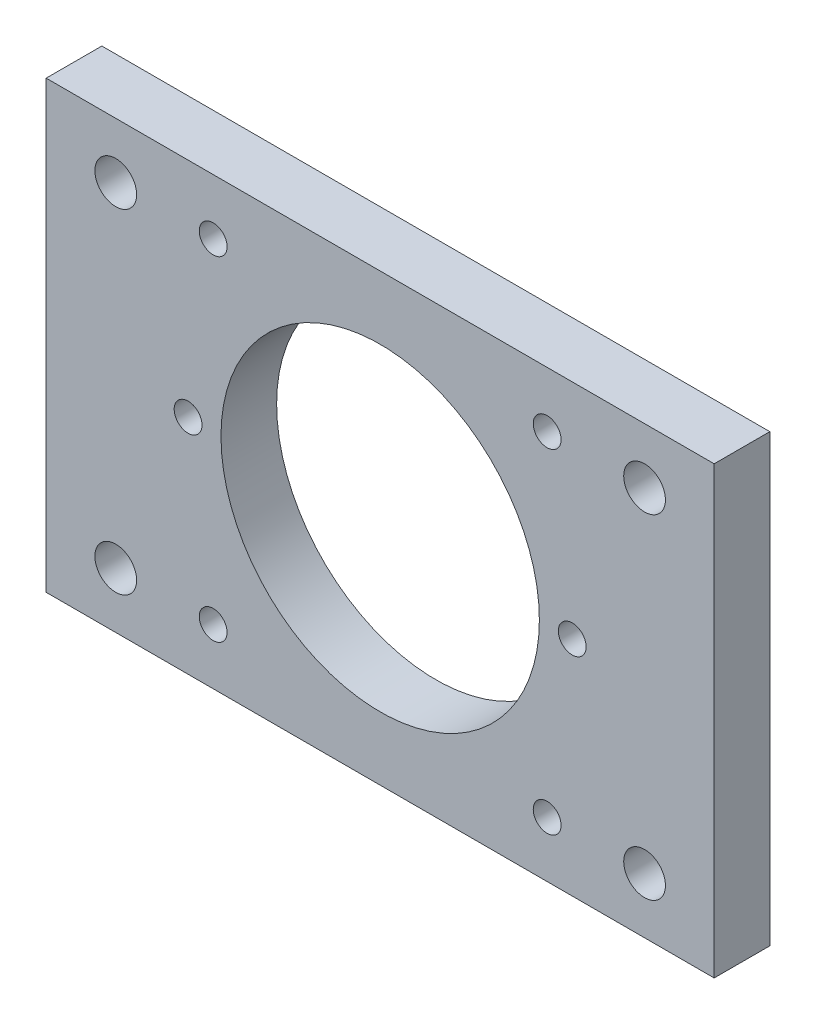
ISO-10303-21;
HEADER;
FILE_DESCRIPTION(('STEP AP214'),'2;1');
FILE_NAME('part.step','',(''),(''),'','','');
FILE_SCHEMA(('AUTOMOTIVE_DESIGN { 1 0 10303 214 1 1 1 1 }'));
ENDSEC;
DATA;
#1=APPLICATION_CONTEXT('core data for automotive mechanical design processes');
#2=APPLICATION_PROTOCOL_DEFINITION('international standard','automotive_design',2000,#1);
#3=PRODUCT_CONTEXT('',#1,'mechanical');
#4=PRODUCT('Part','Part','',(#3));
#5=PRODUCT_RELATED_PRODUCT_CATEGORY('part','',(#4));
#6=PRODUCT_DEFINITION_FORMATION('','',#4);
#7=PRODUCT_DEFINITION_CONTEXT('part definition',#1,'design');
#8=PRODUCT_DEFINITION('design','',#6,#7);
#9=PRODUCT_DEFINITION_SHAPE('','',#8);
#10=(LENGTH_UNIT() NAMED_UNIT(*) SI_UNIT(.MILLI.,.METRE.));
#11=(NAMED_UNIT(*) PLANE_ANGLE_UNIT() SI_UNIT($,.RADIAN.));
#12=(NAMED_UNIT(*) SI_UNIT($,.STERADIAN.) SOLID_ANGLE_UNIT());
#13=UNCERTAINTY_MEASURE_WITH_UNIT(LENGTH_MEASURE(1.E-05),#10,'distance_accuracy_value','');
#14=(GEOMETRIC_REPRESENTATION_CONTEXT(3) GLOBAL_UNCERTAINTY_ASSIGNED_CONTEXT((#13)) GLOBAL_UNIT_ASSIGNED_CONTEXT((#10,
#11,#12)) REPRESENTATION_CONTEXT('',''));
#15=CARTESIAN_POINT('',(0.,0.,0.));
#16=DIRECTION('',(0.,0.,1.));
#17=DIRECTION('',(1.,0.,0.));
#18=AXIS2_PLACEMENT_3D('',#15,#16,#17);
#19=CARTESIAN_POINT('',(0.,50.8,6.35));
#20=DIRECTION('',(0.,0.,-1.));
#21=DIRECTION('',(-1.,0.,0.));
#22=AXIS2_PLACEMENT_3D('',#19,#20,#21);
#23=PLANE('',#22);
#24=CARTESIAN_POINT('',(57.15,44.45,6.35));
#25=DIRECTION('',(0.,0.,-1.));
#26=DIRECTION('',(-1.,0.,0.));
#27=AXIS2_PLACEMENT_3D('',#24,#25,#26);
#28=CIRCLE('',#27,1.5875);
#29=CARTESIAN_POINT('',(55.5625,44.45,6.35));
#30=VERTEX_POINT('',#29);
#31=EDGE_CURVE('E284',#30,#30,#28,.T.);
#32=ORIENTED_EDGE('',*,*,#31,.T.);
#33=EDGE_LOOP('',(#32));
#34=FACE_BOUND('',#33,.T.);
#35=CARTESIAN_POINT('',(19.05,44.4499999999999,6.35));
#36=DIRECTION('',(0.,0.,-1.));
#37=DIRECTION('',(-1.,0.,0.));
#38=AXIS2_PLACEMENT_3D('',#35,#36,#37);
#39=CIRCLE('',#38,1.5875);
#40=CARTESIAN_POINT('',(17.4625,44.4499999999999,6.35));
#41=VERTEX_POINT('',#40);
#42=EDGE_CURVE('E292',#41,#41,#39,.T.);
#43=ORIENTED_EDGE('',*,*,#42,.T.);
#44=EDGE_LOOP('',(#43));
#45=FACE_BOUND('',#44,.T.);
#46=CARTESIAN_POINT('',(57.15,6.34999999999998,6.35));
#47=DIRECTION('',(0.,0.,-1.));
#48=DIRECTION('',(-1.,0.,0.));
#49=AXIS2_PLACEMENT_3D('',#46,#47,#48);
#50=CIRCLE('',#49,1.5875);
#51=CARTESIAN_POINT('',(55.5625,6.34999999999998,6.35));
#52=VERTEX_POINT('',#51);
#53=EDGE_CURVE('E298',#52,#52,#50,.T.);
#54=ORIENTED_EDGE('',*,*,#53,.T.);
#55=EDGE_LOOP('',(#54));
#56=FACE_BOUND('',#55,.T.);
#57=CARTESIAN_POINT('',(19.05,6.34999999999997,6.35));
#58=DIRECTION('',(0.,0.,-1.));
#59=DIRECTION('',(-1.,0.,0.));
#60=AXIS2_PLACEMENT_3D('',#57,#58,#59);
#61=CIRCLE('',#60,1.5875);
#62=CARTESIAN_POINT('',(17.4625,6.34999999999997,6.35));
#63=VERTEX_POINT('',#62);
#64=EDGE_CURVE('E135',#63,#63,#61,.T.);
#65=ORIENTED_EDGE('',*,*,#64,.T.);
#66=EDGE_LOOP('',(#65));
#67=FACE_BOUND('',#66,.T.);
#68=CARTESIAN_POINT('',(7.93750000000001,44.45,6.35));
#69=DIRECTION('',(0.,0.,1.));
#70=DIRECTION('',(1.,0.,0.));
#71=AXIS2_PLACEMENT_3D('',#68,#69,#70);
#72=CIRCLE('',#71,2.38125);
#73=CARTESIAN_POINT('',(10.31875,44.45,6.35));
#74=VERTEX_POINT('',#73);
#75=EDGE_CURVE('E149',#74,#74,#72,.T.);
#76=ORIENTED_EDGE('',*,*,#75,.F.);
#77=EDGE_LOOP('',(#76));
#78=FACE_BOUND('',#77,.T.);
#79=CARTESIAN_POINT('',(68.2625,44.45,6.35));
#80=DIRECTION('',(0.,0.,-1.));
#81=DIRECTION('',(-1.,0.,0.));
#82=AXIS2_PLACEMENT_3D('',#79,#80,#81);
#83=CIRCLE('',#82,2.38125);
#84=CARTESIAN_POINT('',(65.88125,44.45,6.35));
#85=VERTEX_POINT('',#84);
#86=EDGE_CURVE('E155',#85,#85,#83,.T.);
#87=ORIENTED_EDGE('',*,*,#86,.T.);
#88=EDGE_LOOP('',(#87));
#89=FACE_BOUND('',#88,.T.);
#90=CARTESIAN_POINT('',(16.1881750645913,25.4,6.35));
#91=DIRECTION('',(0.,0.,-1.));
#92=DIRECTION('',(-1.,0.,0.));
#93=AXIS2_PLACEMENT_3D('',#90,#91,#92);
#94=CIRCLE('',#93,1.5875);
#95=CARTESIAN_POINT('',(14.6006750645913,25.4,6.35));
#96=VERTEX_POINT('',#95);
#97=EDGE_CURVE('E165',#96,#96,#94,.F.);
#98=ORIENTED_EDGE('',*,*,#97,.F.);
#99=EDGE_LOOP('',(#98));
#100=FACE_BOUND('',#99,.T.);
#101=DIRECTION('',(0.,-1.,0.));
#102=VECTOR('',#101,1.);
#103=CARTESIAN_POINT('',(0.,0.,6.35));
#104=LINE('',#103,#102);
#105=CARTESIAN_POINT('',(0.,50.8,6.35));
#106=VERTEX_POINT('',#105);
#107=CARTESIAN_POINT('',(0.,0.,6.35));
#108=VERTEX_POINT('',#107);
#109=EDGE_CURVE('E88',#106,#108,#104,.T.);
#110=ORIENTED_EDGE('',*,*,#109,.T.);
#111=DIRECTION('',(1.,0.,0.));
#112=VECTOR('',#111,1.);
#113=CARTESIAN_POINT('',(0.,0.,6.35));
#114=LINE('',#113,#112);
#115=CARTESIAN_POINT('',(76.2,0.,6.35));
#116=VERTEX_POINT('',#115);
#117=EDGE_CURVE('E83',#108,#116,#114,.T.);
#118=ORIENTED_EDGE('',*,*,#117,.T.);
#119=DIRECTION('',(0.,1.,0.));
#120=VECTOR('',#119,1.);
#121=CARTESIAN_POINT('',(76.2,0.,6.35));
#122=LINE('',#121,#120);
#123=CARTESIAN_POINT('',(76.2,50.8,6.35));
#124=VERTEX_POINT('',#123);
#125=EDGE_CURVE('E86',#116,#124,#122,.T.);
#126=ORIENTED_EDGE('',*,*,#125,.T.);
#127=DIRECTION('',(-1.,0.,0.));
#128=VECTOR('',#127,1.);
#129=CARTESIAN_POINT('',(0.,50.8,6.35));
#130=LINE('',#129,#128);
#131=EDGE_CURVE('E52',#124,#106,#130,.T.);
#132=ORIENTED_EDGE('',*,*,#131,.T.);
#133=EDGE_LOOP('',(#110,#118,#126,#132));
#134=FACE_BOUND('',#133,.T.);
#135=CARTESIAN_POINT('',(38.1,25.4,6.35));
#136=DIRECTION('',(0.,0.,-1.));
#137=DIRECTION('',(-1.,0.,0.));
#138=AXIS2_PLACEMENT_3D('',#135,#136,#137);
#139=CIRCLE('',#138,18.161);
#140=CARTESIAN_POINT('',(19.939,25.4,6.35));
#141=VERTEX_POINT('',#140);
#142=EDGE_CURVE('E162',#141,#141,#139,.F.);
#143=ORIENTED_EDGE('',*,*,#142,.F.);
#144=EDGE_LOOP('',(#143));
#145=FACE_BOUND('',#144,.T.);
#146=CARTESIAN_POINT('',(60.0118249354087,25.4,6.35));
#147=DIRECTION('',(0.,0.,-1.));
#148=DIRECTION('',(-1.,0.,0.));
#149=AXIS2_PLACEMENT_3D('',#146,#147,#148);
#150=CIRCLE('',#149,1.5875);
#151=CARTESIAN_POINT('',(58.4243249354087,25.4,6.35));
#152=VERTEX_POINT('',#151);
#153=EDGE_CURVE('E105',#152,#152,#150,.F.);
#154=ORIENTED_EDGE('',*,*,#153,.F.);
#155=EDGE_LOOP('',(#154));
#156=FACE_BOUND('',#155,.T.);
#157=CARTESIAN_POINT('',(7.9375,6.35,6.35));
#158=DIRECTION('',(0.,0.,-1.));
#159=DIRECTION('',(1.,0.,0.));
#160=AXIS2_PLACEMENT_3D('',#157,#158,#159);
#161=CIRCLE('',#160,2.38125);
#162=CARTESIAN_POINT('',(10.31875,6.35,6.35));
#163=VERTEX_POINT('',#162);
#164=EDGE_CURVE('E144',#163,#163,#161,.T.);
#165=ORIENTED_EDGE('',*,*,#164,.T.);
#166=EDGE_LOOP('',(#165));
#167=FACE_BOUND('',#166,.T.);
#168=CARTESIAN_POINT('',(68.2625,6.35,6.35));
#169=DIRECTION('',(0.,0.,1.));
#170=DIRECTION('',(-1.,0.,0.));
#171=AXIS2_PLACEMENT_3D('',#168,#169,#170);
#172=CIRCLE('',#171,2.38125);
#173=CARTESIAN_POINT('',(65.88125,6.35,6.35));
#174=VERTEX_POINT('',#173);
#175=EDGE_CURVE('E134',#174,#174,#172,.T.);
#176=ORIENTED_EDGE('',*,*,#175,.F.);
#177=EDGE_LOOP('',(#176));
#178=FACE_BOUND('',#177,.T.);
#179=ADVANCED_FACE('F35',(#34,#45,#56,#67,#78,#89,#100,#134,#145,#156,#167,#178),#23,.F.);
#180=CARTESIAN_POINT('',(0.,50.8,0.));
#181=DIRECTION('',(0.,0.,-1.));
#182=DIRECTION('',(-1.,0.,0.));
#183=AXIS2_PLACEMENT_3D('',#180,#181,#182);
#184=PLANE('',#183);
#185=CARTESIAN_POINT('',(57.15,44.45,0.));
#186=DIRECTION('',(0.,0.,-1.));
#187=DIRECTION('',(-1.,0.,0.));
#188=AXIS2_PLACEMENT_3D('',#185,#186,#187);
#189=CIRCLE('',#188,1.5875);
#190=CARTESIAN_POINT('',(55.5625,44.45,0.));
#191=VERTEX_POINT('',#190);
#192=EDGE_CURVE('E287',#191,#191,#189,.T.);
#193=ORIENTED_EDGE('',*,*,#192,.F.);
#194=EDGE_LOOP('',(#193));
#195=FACE_BOUND('',#194,.T.);
#196=CARTESIAN_POINT('',(19.05,44.4499999999999,0.));
#197=DIRECTION('',(0.,0.,-1.));
#198=DIRECTION('',(-1.,0.,0.));
#199=AXIS2_PLACEMENT_3D('',#196,#197,#198);
#200=CIRCLE('',#199,1.5875);
#201=CARTESIAN_POINT('',(17.4625,44.4499999999999,0.));
#202=VERTEX_POINT('',#201);
#203=EDGE_CURVE('E289',#202,#202,#200,.T.);
#204=ORIENTED_EDGE('',*,*,#203,.F.);
#205=EDGE_LOOP('',(#204));
#206=FACE_BOUND('',#205,.T.);
#207=CARTESIAN_POINT('',(57.15,6.34999999999998,0.));
#208=DIRECTION('',(0.,0.,-1.));
#209=DIRECTION('',(-1.,0.,0.));
#210=AXIS2_PLACEMENT_3D('',#207,#208,#209);
#211=CIRCLE('',#210,1.5875);
#212=CARTESIAN_POINT('',(55.5625,6.34999999999998,0.));
#213=VERTEX_POINT('',#212);
#214=EDGE_CURVE('E295',#213,#213,#211,.T.);
#215=ORIENTED_EDGE('',*,*,#214,.F.);
#216=EDGE_LOOP('',(#215));
#217=FACE_BOUND('',#216,.T.);
#218=CARTESIAN_POINT('',(19.05,6.34999999999997,0.));
#219=DIRECTION('',(0.,0.,-1.));
#220=DIRECTION('',(-1.,0.,0.));
#221=AXIS2_PLACEMENT_3D('',#218,#219,#220);
#222=CIRCLE('',#221,1.5875);
#223=CARTESIAN_POINT('',(17.4625,6.34999999999997,0.));
#224=VERTEX_POINT('',#223);
#225=EDGE_CURVE('E140',#224,#224,#222,.T.);
#226=ORIENTED_EDGE('',*,*,#225,.F.);
#227=EDGE_LOOP('',(#226));
#228=FACE_BOUND('',#227,.T.);
#229=CARTESIAN_POINT('',(7.93750000000001,44.45,0.));
#230=DIRECTION('',(0.,0.,1.));
#231=DIRECTION('',(1.,0.,0.));
#232=AXIS2_PLACEMENT_3D('',#229,#230,#231);
#233=CIRCLE('',#232,2.38125);
#234=CARTESIAN_POINT('',(10.31875,44.45,0.));
#235=VERTEX_POINT('',#234);
#236=EDGE_CURVE('E147',#235,#235,#233,.T.);
#237=ORIENTED_EDGE('',*,*,#236,.T.);
#238=EDGE_LOOP('',(#237));
#239=FACE_BOUND('',#238,.T.);
#240=CARTESIAN_POINT('',(68.2625,44.45,0.));
#241=DIRECTION('',(0.,0.,-1.));
#242=DIRECTION('',(-1.,0.,0.));
#243=AXIS2_PLACEMENT_3D('',#240,#241,#242);
#244=CIRCLE('',#243,2.38125);
#245=CARTESIAN_POINT('',(65.88125,44.45,0.));
#246=VERTEX_POINT('',#245);
#247=EDGE_CURVE('E152',#246,#246,#244,.T.);
#248=ORIENTED_EDGE('',*,*,#247,.F.);
#249=EDGE_LOOP('',(#248));
#250=FACE_BOUND('',#249,.T.);
#251=CARTESIAN_POINT('',(38.1,25.4,0.));
#252=DIRECTION('',(0.,0.,-1.));
#253=DIRECTION('',(-1.,0.,0.));
#254=AXIS2_PLACEMENT_3D('',#251,#252,#253);
#255=CIRCLE('',#254,18.161);
#256=CARTESIAN_POINT('',(19.939,25.4,0.));
#257=VERTEX_POINT('',#256);
#258=EDGE_CURVE('E11',#257,#257,#255,.F.);
#259=ORIENTED_EDGE('',*,*,#258,.T.);
#260=EDGE_LOOP('',(#259));
#261=FACE_BOUND('',#260,.T.);
#262=DIRECTION('',(0.,-1.,0.));
#263=VECTOR('',#262,1.);
#264=CARTESIAN_POINT('',(0.,0.,0.));
#265=LINE('',#264,#263);
#266=CARTESIAN_POINT('',(0.,50.8,0.));
#267=VERTEX_POINT('',#266);
#268=CARTESIAN_POINT('',(0.,0.,0.));
#269=VERTEX_POINT('',#268);
#270=EDGE_CURVE('E102',#267,#269,#265,.T.);
#271=ORIENTED_EDGE('',*,*,#270,.F.);
#272=DIRECTION('',(-1.,0.,0.));
#273=VECTOR('',#272,1.);
#274=CARTESIAN_POINT('',(0.,50.8,0.));
#275=LINE('',#274,#273);
#276=CARTESIAN_POINT('',(76.2,50.8,0.));
#277=VERTEX_POINT('',#276);
#278=EDGE_CURVE('E75',#277,#267,#275,.T.);
#279=ORIENTED_EDGE('',*,*,#278,.F.);
#280=DIRECTION('',(0.,1.,0.));
#281=VECTOR('',#280,1.);
#282=CARTESIAN_POINT('',(76.2,0.,0.));
#283=LINE('',#282,#281);
#284=CARTESIAN_POINT('',(76.2,0.,0.));
#285=VERTEX_POINT('',#284);
#286=EDGE_CURVE('E69',#285,#277,#283,.T.);
#287=ORIENTED_EDGE('',*,*,#286,.F.);
#288=DIRECTION('',(1.,0.,0.));
#289=VECTOR('',#288,1.);
#290=CARTESIAN_POINT('',(0.,0.,0.));
#291=LINE('',#290,#289);
#292=EDGE_CURVE('E93',#269,#285,#291,.T.);
#293=ORIENTED_EDGE('',*,*,#292,.F.);
#294=EDGE_LOOP('',(#271,#279,#287,#293));
#295=FACE_BOUND('',#294,.T.);
#296=CARTESIAN_POINT('',(60.0118249354087,25.4,0.));
#297=DIRECTION('',(0.,0.,1.));
#298=DIRECTION('',(0.707106781186548,-0.707106781186548,0.));
#299=AXIS2_PLACEMENT_3D('',#296,#297,#298);
#300=CIRCLE('',#299,1.5875);
#301=CARTESIAN_POINT('',(61.1343569505423,24.2774679848664,0.));
#302=VERTEX_POINT('',#301);
#303=EDGE_CURVE('E121',#302,#302,#300,.T.);
#304=ORIENTED_EDGE('',*,*,#303,.T.);
#305=EDGE_LOOP('',(#304));
#306=FACE_BOUND('',#305,.T.);
#307=CARTESIAN_POINT('',(16.1881750645913,25.4,0.));
#308=DIRECTION('',(0.,0.,1.));
#309=DIRECTION('',(0.707106781186548,-0.707106781186548,0.));
#310=AXIS2_PLACEMENT_3D('',#307,#308,#309);
#311=CIRCLE('',#310,1.5875);
#312=CARTESIAN_POINT('',(17.3107070797249,24.2774679848663,0.));
#313=VERTEX_POINT('',#312);
#314=EDGE_CURVE('E125',#313,#313,#311,.T.);
#315=ORIENTED_EDGE('',*,*,#314,.T.);
#316=EDGE_LOOP('',(#315));
#317=FACE_BOUND('',#316,.T.);
#318=CARTESIAN_POINT('',(7.9375,6.35,0.));
#319=DIRECTION('',(0.,0.,-1.));
#320=DIRECTION('',(1.,0.,0.));
#321=AXIS2_PLACEMENT_3D('',#318,#319,#320);
#322=CIRCLE('',#321,2.38125);
#323=CARTESIAN_POINT('',(10.31875,6.35,0.));
#324=VERTEX_POINT('',#323);
#325=EDGE_CURVE('E129',#324,#324,#322,.T.);
#326=ORIENTED_EDGE('',*,*,#325,.F.);
#327=EDGE_LOOP('',(#326));
#328=FACE_BOUND('',#327,.T.);
#329=CARTESIAN_POINT('',(68.2625,6.35,0.));
#330=DIRECTION('',(0.,0.,1.));
#331=DIRECTION('',(-1.,0.,0.));
#332=AXIS2_PLACEMENT_3D('',#329,#330,#331);
#333=CIRCLE('',#332,2.38125);
#334=CARTESIAN_POINT('',(65.88125,6.35,0.));
#335=VERTEX_POINT('',#334);
#336=EDGE_CURVE('E132',#335,#335,#333,.T.);
#337=ORIENTED_EDGE('',*,*,#336,.T.);
#338=EDGE_LOOP('',(#337));
#339=FACE_BOUND('',#338,.T.);
#340=ADVANCED_FACE('F113',(#195,#206,#217,#228,#239,#250,#261,#295,#306,#317,#328,#339),#184,.T.);
#341=CARTESIAN_POINT('',(0.,0.,6.35));
#342=DIRECTION('',(1.,0.,0.));
#343=DIRECTION('',(0.,1.,0.));
#344=AXIS2_PLACEMENT_3D('',#341,#342,#343);
#345=PLANE('',#344);
#346=ORIENTED_EDGE('',*,*,#270,.T.);
#347=DIRECTION('',(0.,0.,-1.));
#348=VECTOR('',#347,1.);
#349=CARTESIAN_POINT('',(0.,0.,6.35));
#350=LINE('',#349,#348);
#351=EDGE_CURVE('E44',#108,#269,#350,.T.);
#352=ORIENTED_EDGE('',*,*,#351,.F.);
#353=ORIENTED_EDGE('',*,*,#109,.F.);
#354=DIRECTION('',(0.,0.,-1.));
#355=VECTOR('',#354,1.);
#356=CARTESIAN_POINT('',(0.,50.8,6.35));
#357=LINE('',#356,#355);
#358=EDGE_CURVE('E98',#106,#267,#357,.T.);
#359=ORIENTED_EDGE('',*,*,#358,.T.);
#360=EDGE_LOOP('',(#346,#352,#353,#359));
#361=FACE_BOUND('',#360,.T.);
#362=ADVANCED_FACE('F37',(#361),#345,.F.);
#363=CARTESIAN_POINT('',(0.,0.,6.35));
#364=DIRECTION('',(0.,1.,0.));
#365=DIRECTION('',(0.,0.,1.));
#366=AXIS2_PLACEMENT_3D('',#363,#364,#365);
#367=PLANE('',#366);
#368=ORIENTED_EDGE('',*,*,#292,.T.);
#369=DIRECTION('',(0.,0.,-1.));
#370=VECTOR('',#369,1.);
#371=CARTESIAN_POINT('',(76.2,0.,6.35));
#372=LINE('',#371,#370);
#373=EDGE_CURVE('E91',#116,#285,#372,.T.);
#374=ORIENTED_EDGE('',*,*,#373,.F.);
#375=ORIENTED_EDGE('',*,*,#117,.F.);
#376=ORIENTED_EDGE('',*,*,#351,.T.);
#377=EDGE_LOOP('',(#368,#374,#375,#376));
#378=FACE_BOUND('',#377,.T.);
#379=ADVANCED_FACE('F92',(#378),#367,.F.);
#380=CARTESIAN_POINT('',(76.2,0.,6.35));
#381=DIRECTION('',(-1.,0.,0.));
#382=DIRECTION('',(0.,-1.,0.));
#383=AXIS2_PLACEMENT_3D('',#380,#381,#382);
#384=PLANE('',#383);
#385=ORIENTED_EDGE('',*,*,#286,.T.);
#386=DIRECTION('',(0.,0.,-1.));
#387=VECTOR('',#386,1.);
#388=CARTESIAN_POINT('',(76.2,50.8,6.35));
#389=LINE('',#388,#387);
#390=EDGE_CURVE('E94',#124,#277,#389,.T.);
#391=ORIENTED_EDGE('',*,*,#390,.F.);
#392=ORIENTED_EDGE('',*,*,#125,.F.);
#393=ORIENTED_EDGE('',*,*,#373,.T.);
#394=EDGE_LOOP('',(#385,#391,#392,#393));
#395=FACE_BOUND('',#394,.T.);
#396=ADVANCED_FACE('F96',(#395),#384,.F.);
#397=CARTESIAN_POINT('',(0.,50.8,6.35));
#398=DIRECTION('',(0.,-1.,0.));
#399=DIRECTION('',(0.,0.,-1.));
#400=AXIS2_PLACEMENT_3D('',#397,#398,#399);
#401=PLANE('',#400);
#402=ORIENTED_EDGE('',*,*,#278,.T.);
#403=ORIENTED_EDGE('',*,*,#358,.F.);
#404=ORIENTED_EDGE('',*,*,#131,.F.);
#405=ORIENTED_EDGE('',*,*,#390,.T.);
#406=EDGE_LOOP('',(#402,#403,#404,#405));
#407=FACE_BOUND('',#406,.T.);
#408=ADVANCED_FACE('F209',(#407),#401,.F.);
#409=CARTESIAN_POINT('',(38.1,25.4,-2.54));
#410=DIRECTION('',(0.,0.,1.));
#411=DIRECTION('',(0.707106781186548,-0.707106781186548,0.));
#412=AXIS2_PLACEMENT_3D('',#409,#410,#411);
#413=CYLINDRICAL_SURFACE('',#412,18.161);
#414=ORIENTED_EDGE('',*,*,#258,.F.);
#415=EDGE_LOOP('',(#414));
#416=FACE_BOUND('',#415,.T.);
#417=ORIENTED_EDGE('',*,*,#142,.T.);
#418=EDGE_LOOP('',(#417));
#419=FACE_BOUND('',#418,.T.);
#420=ADVANCED_FACE('F205',(#416,#419),#413,.F.);
#421=CARTESIAN_POINT('',(16.1881750645913,25.4,25.4));
#422=DIRECTION('',(0.,0.,-1.));
#423=DIRECTION('',(-0.707106781186548,0.707106781186548,0.));
#424=AXIS2_PLACEMENT_3D('',#421,#422,#423);
#425=CYLINDRICAL_SURFACE('',#424,1.5875);
#426=ORIENTED_EDGE('',*,*,#314,.F.);
#427=EDGE_LOOP('',(#426));
#428=FACE_BOUND('',#427,.T.);
#429=ORIENTED_EDGE('',*,*,#97,.T.);
#430=EDGE_LOOP('',(#429));
#431=FACE_BOUND('',#430,.T.);
#432=ADVANCED_FACE('F208',(#428,#431),#425,.F.);
#433=CARTESIAN_POINT('',(60.0118249354087,25.4,25.4));
#434=DIRECTION('',(0.,0.,-1.));
#435=DIRECTION('',(-0.707106781186548,0.707106781186548,0.));
#436=AXIS2_PLACEMENT_3D('',#433,#434,#435);
#437=CYLINDRICAL_SURFACE('',#436,1.5875);
#438=ORIENTED_EDGE('',*,*,#303,.F.);
#439=EDGE_LOOP('',(#438));
#440=FACE_BOUND('',#439,.T.);
#441=ORIENTED_EDGE('',*,*,#153,.T.);
#442=EDGE_LOOP('',(#441));
#443=FACE_BOUND('',#442,.T.);
#444=ADVANCED_FACE('F171',(#440,#443),#437,.F.);
#445=CARTESIAN_POINT('',(68.2625,44.45,6.35));
#446=DIRECTION('',(0.,0.,-1.));
#447=DIRECTION('',(-1.,0.,0.));
#448=AXIS2_PLACEMENT_3D('',#445,#446,#447);
#449=CYLINDRICAL_SURFACE('',#448,2.38125);
#450=ORIENTED_EDGE('',*,*,#86,.F.);
#451=EDGE_LOOP('',(#450));
#452=FACE_BOUND('',#451,.T.);
#453=ORIENTED_EDGE('',*,*,#247,.T.);
#454=EDGE_LOOP('',(#453));
#455=FACE_BOUND('',#454,.T.);
#456=ADVANCED_FACE('F200',(#452,#455),#449,.F.);
#457=CARTESIAN_POINT('',(7.93750000000001,44.45,6.35));
#458=DIRECTION('',(0.,0.,-1.));
#459=DIRECTION('',(-1.,0.,0.));
#460=AXIS2_PLACEMENT_3D('',#457,#458,#459);
#461=CYLINDRICAL_SURFACE('',#460,2.38125);
#462=ORIENTED_EDGE('',*,*,#75,.T.);
#463=EDGE_LOOP('',(#462));
#464=FACE_BOUND('',#463,.T.);
#465=ORIENTED_EDGE('',*,*,#236,.F.);
#466=EDGE_LOOP('',(#465));
#467=FACE_BOUND('',#466,.T.);
#468=ADVANCED_FACE('F193',(#464,#467),#461,.F.);
#469=CARTESIAN_POINT('',(7.9375,6.35,6.35));
#470=DIRECTION('',(0.,0.,-1.));
#471=DIRECTION('',(-1.,0.,0.));
#472=AXIS2_PLACEMENT_3D('',#469,#470,#471);
#473=CYLINDRICAL_SURFACE('',#472,2.38125);
#474=ORIENTED_EDGE('',*,*,#164,.F.);
#475=EDGE_LOOP('',(#474));
#476=FACE_BOUND('',#475,.T.);
#477=ORIENTED_EDGE('',*,*,#325,.T.);
#478=EDGE_LOOP('',(#477));
#479=FACE_BOUND('',#478,.T.);
#480=ADVANCED_FACE('F184',(#476,#479),#473,.F.);
#481=CARTESIAN_POINT('',(68.2625,6.35,6.35));
#482=DIRECTION('',(0.,0.,-1.));
#483=DIRECTION('',(-1.,0.,0.));
#484=AXIS2_PLACEMENT_3D('',#481,#482,#483);
#485=CYLINDRICAL_SURFACE('',#484,2.38125);
#486=ORIENTED_EDGE('',*,*,#175,.T.);
#487=EDGE_LOOP('',(#486));
#488=FACE_BOUND('',#487,.T.);
#489=ORIENTED_EDGE('',*,*,#336,.F.);
#490=EDGE_LOOP('',(#489));
#491=FACE_BOUND('',#490,.T.);
#492=ADVANCED_FACE('F181',(#488,#491),#485,.F.);
#493=CARTESIAN_POINT('',(19.05,6.34999999999997,6.35));
#494=DIRECTION('',(0.,0.,-1.));
#495=DIRECTION('',(-1.,0.,0.));
#496=AXIS2_PLACEMENT_3D('',#493,#494,#495);
#497=CYLINDRICAL_SURFACE('',#496,1.5875);
#498=ORIENTED_EDGE('',*,*,#64,.F.);
#499=EDGE_LOOP('',(#498));
#500=FACE_BOUND('',#499,.T.);
#501=ORIENTED_EDGE('',*,*,#225,.T.);
#502=EDGE_LOOP('',(#501));
#503=FACE_BOUND('',#502,.T.);
#504=ADVANCED_FACE('F183',(#500,#503),#497,.F.);
#505=CARTESIAN_POINT('',(57.15,6.34999999999998,6.35));
#506=DIRECTION('',(0.,0.,-1.));
#507=DIRECTION('',(-1.,0.,0.));
#508=AXIS2_PLACEMENT_3D('',#505,#506,#507);
#509=CYLINDRICAL_SURFACE('',#508,1.5875);
#510=ORIENTED_EDGE('',*,*,#53,.F.);
#511=EDGE_LOOP('',(#510));
#512=FACE_BOUND('',#511,.T.);
#513=ORIENTED_EDGE('',*,*,#214,.T.);
#514=EDGE_LOOP('',(#513));
#515=FACE_BOUND('',#514,.T.);
#516=ADVANCED_FACE('F190',(#512,#515),#509,.F.);
#517=CARTESIAN_POINT('',(19.05,44.4499999999999,6.35));
#518=DIRECTION('',(0.,0.,-1.));
#519=DIRECTION('',(-1.,0.,0.));
#520=AXIS2_PLACEMENT_3D('',#517,#518,#519);
#521=CYLINDRICAL_SURFACE('',#520,1.5875);
#522=ORIENTED_EDGE('',*,*,#42,.F.);
#523=EDGE_LOOP('',(#522));
#524=FACE_BOUND('',#523,.T.);
#525=ORIENTED_EDGE('',*,*,#203,.T.);
#526=EDGE_LOOP('',(#525));
#527=FACE_BOUND('',#526,.T.);
#528=ADVANCED_FACE('F258',(#524,#527),#521,.F.);
#529=CARTESIAN_POINT('',(57.15,44.45,6.35));
#530=DIRECTION('',(0.,0.,-1.));
#531=DIRECTION('',(-1.,0.,0.));
#532=AXIS2_PLACEMENT_3D('',#529,#530,#531);
#533=CYLINDRICAL_SURFACE('',#532,1.5875);
#534=ORIENTED_EDGE('',*,*,#31,.F.);
#535=EDGE_LOOP('',(#534));
#536=FACE_BOUND('',#535,.T.);
#537=ORIENTED_EDGE('',*,*,#192,.T.);
#538=EDGE_LOOP('',(#537));
#539=FACE_BOUND('',#538,.T.);
#540=ADVANCED_FACE('F267',(#536,#539),#533,.F.);
#541=CLOSED_SHELL('',(#179,#340,#362,#379,#396,#408,#420,#432,#444,#456,#468,#480,#492,#504,
#516,#528,#540));
#542=MANIFOLD_SOLID_BREP('B2',#541);
#543=ADVANCED_BREP_SHAPE_REPRESENTATION('',(#18,#542),#14);
#544=SHAPE_DEFINITION_REPRESENTATION(#9,#543);
ENDSEC;
END-ISO-10303-21;
